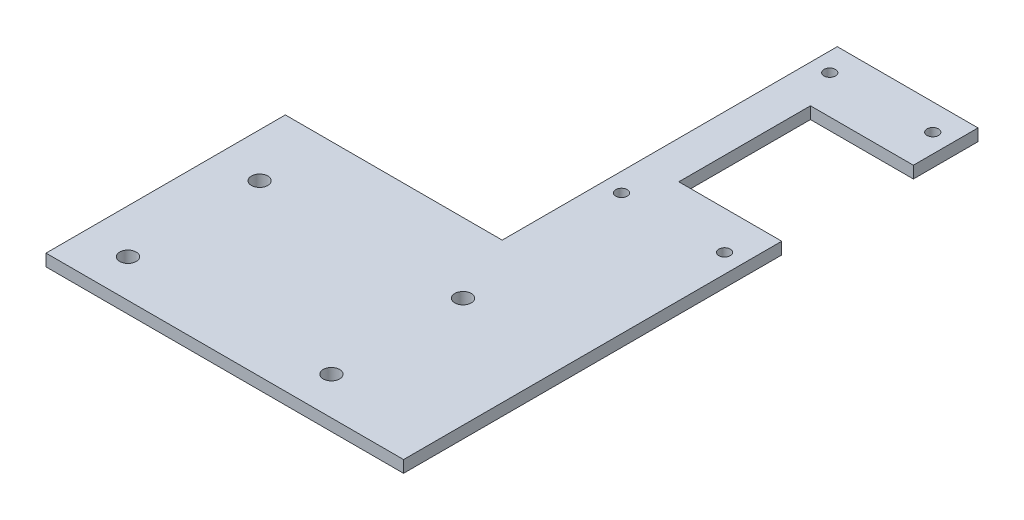
ISO-10303-21;
HEADER;
FILE_DESCRIPTION(('STEP AP214'),'2;1');
FILE_NAME('part.step','',(''),(''),'','','');
FILE_SCHEMA(('AUTOMOTIVE_DESIGN { 1 0 10303 214 1 1 1 1 }'));
ENDSEC;
DATA;
#1=APPLICATION_CONTEXT('core data for automotive mechanical design processes');
#2=APPLICATION_PROTOCOL_DEFINITION('international standard','automotive_design',2000,#1);
#3=PRODUCT_CONTEXT('',#1,'mechanical');
#4=PRODUCT('Part','Part','',(#3));
#5=PRODUCT_RELATED_PRODUCT_CATEGORY('part','',(#4));
#6=PRODUCT_DEFINITION_FORMATION('','',#4);
#7=PRODUCT_DEFINITION_CONTEXT('part definition',#1,'design');
#8=PRODUCT_DEFINITION('design','',#6,#7);
#9=PRODUCT_DEFINITION_SHAPE('','',#8);
#10=(LENGTH_UNIT() NAMED_UNIT(*) SI_UNIT(.MILLI.,.METRE.));
#11=(NAMED_UNIT(*) PLANE_ANGLE_UNIT() SI_UNIT($,.RADIAN.));
#12=(NAMED_UNIT(*) SI_UNIT($,.STERADIAN.) SOLID_ANGLE_UNIT());
#13=UNCERTAINTY_MEASURE_WITH_UNIT(LENGTH_MEASURE(1.E-05),#10,'distance_accuracy_value','');
#14=(GEOMETRIC_REPRESENTATION_CONTEXT(3) GLOBAL_UNCERTAINTY_ASSIGNED_CONTEXT((#13)) GLOBAL_UNIT_ASSIGNED_CONTEXT((#10,
#11,#12)) REPRESENTATION_CONTEXT('',''));
#15=CARTESIAN_POINT('',(0.,0.,0.));
#16=DIRECTION('',(0.,0.,1.));
#17=DIRECTION('',(1.,0.,0.));
#18=AXIS2_PLACEMENT_3D('',#15,#16,#17);
#19=CARTESIAN_POINT('',(0.,6.35,25.4));
#20=DIRECTION('',(0.,0.,1.));
#21=DIRECTION('',(1.,0.,0.));
#22=AXIS2_PLACEMENT_3D('',#19,#20,#21);
#23=PLANE('',#22);
#24=DIRECTION('',(-1.,0.,0.));
#25=VECTOR('',#24,1.);
#26=CARTESIAN_POINT('',(0.,0.,25.4));
#27=LINE('',#26,#25);
#28=CARTESIAN_POINT('',(77.73162,0.,25.4));
#29=VERTEX_POINT('',#28);
#30=CARTESIAN_POINT('',(-37.33419,0.,25.4));
#31=VERTEX_POINT('',#30);
#32=EDGE_CURVE('E192',#29,#31,#27,.T.);
#33=ORIENTED_EDGE('',*,*,#32,.T.);
#34=DIRECTION('',(0.,-1.,0.));
#35=VECTOR('',#34,1.);
#36=CARTESIAN_POINT('',(-37.33419,6.35,25.4));
#37=LINE('',#36,#35);
#38=CARTESIAN_POINT('',(-37.33419,6.35,25.4));
#39=VERTEX_POINT('',#38);
#40=EDGE_CURVE('E11',#39,#31,#37,.T.);
#41=ORIENTED_EDGE('',*,*,#40,.F.);
#42=DIRECTION('',(-1.,0.,0.));
#43=VECTOR('',#42,1.);
#44=CARTESIAN_POINT('',(0.,6.35,25.4));
#45=LINE('',#44,#43);
#46=CARTESIAN_POINT('',(77.73162,6.35,25.4));
#47=VERTEX_POINT('',#46);
#48=EDGE_CURVE('E309',#47,#39,#45,.T.);
#49=ORIENTED_EDGE('',*,*,#48,.F.);
#50=DIRECTION('',(0.,-1.,0.));
#51=VECTOR('',#50,1.);
#52=CARTESIAN_POINT('',(77.73162,6.35,25.4));
#53=LINE('',#52,#51);
#54=EDGE_CURVE('E155',#47,#29,#53,.T.);
#55=ORIENTED_EDGE('',*,*,#54,.T.);
#56=EDGE_LOOP('',(#33,#41,#49,#55));
#57=FACE_BOUND('',#56,.T.);
#58=ADVANCED_FACE('F45',(#57),#23,.F.);
#59=CARTESIAN_POINT('',(-37.33419,6.35,0.));
#60=DIRECTION('',(1.,0.,0.));
#61=DIRECTION('',(0.,0.,-1.));
#62=AXIS2_PLACEMENT_3D('',#59,#60,#61);
#63=PLANE('',#62);
#64=DIRECTION('',(0.,0.,1.));
#65=VECTOR('',#64,1.);
#66=CARTESIAN_POINT('',(-37.33419,0.,0.));
#67=LINE('',#66,#65);
#68=CARTESIAN_POINT('',(-37.33419,0.,152.4));
#69=VERTEX_POINT('',#68);
#70=EDGE_CURVE('E196',#31,#69,#67,.T.);
#71=ORIENTED_EDGE('',*,*,#70,.T.);
#72=DIRECTION('',(0.,-1.,0.));
#73=VECTOR('',#72,1.);
#74=CARTESIAN_POINT('',(-37.33419,6.35,152.4));
#75=LINE('',#74,#73);
#76=CARTESIAN_POINT('',(-37.33419,6.35,152.4));
#77=VERTEX_POINT('',#76);
#78=EDGE_CURVE('E55',#77,#69,#75,.T.);
#79=ORIENTED_EDGE('',*,*,#78,.F.);
#80=DIRECTION('',(0.,0.,1.));
#81=VECTOR('',#80,1.);
#82=CARTESIAN_POINT('',(-37.33419,6.35,0.));
#83=LINE('',#82,#81);
#84=EDGE_CURVE('E108',#39,#77,#83,.T.);
#85=ORIENTED_EDGE('',*,*,#84,.F.);
#86=ORIENTED_EDGE('',*,*,#40,.T.);
#87=EDGE_LOOP('',(#71,#79,#85,#86));
#88=FACE_BOUND('',#87,.T.);
#89=ADVANCED_FACE('F316',(#88),#63,.F.);
#90=CARTESIAN_POINT('',(0.,6.35,152.4));
#91=DIRECTION('',(0.,0.,-1.));
#92=DIRECTION('',(-1.,0.,0.));
#93=AXIS2_PLACEMENT_3D('',#90,#91,#92);
#94=PLANE('',#93);
#95=DIRECTION('',(1.,0.,0.));
#96=VECTOR('',#95,1.);
#97=CARTESIAN_POINT('',(0.,0.,152.4));
#98=LINE('',#97,#96);
#99=CARTESIAN_POINT('',(152.4,0.,152.4));
#100=VERTEX_POINT('',#99);
#101=EDGE_CURVE('E199',#69,#100,#98,.T.);
#102=ORIENTED_EDGE('',*,*,#101,.T.);
#103=DIRECTION('',(0.,-1.,0.));
#104=VECTOR('',#103,1.);
#105=CARTESIAN_POINT('',(152.4,6.35,152.4));
#106=LINE('',#105,#104);
#107=CARTESIAN_POINT('',(152.4,6.35,152.4));
#108=VERTEX_POINT('',#107);
#109=EDGE_CURVE('E239',#108,#100,#106,.T.);
#110=ORIENTED_EDGE('',*,*,#109,.F.);
#111=DIRECTION('',(1.,0.,0.));
#112=VECTOR('',#111,1.);
#113=CARTESIAN_POINT('',(0.,6.35,152.4));
#114=LINE('',#113,#112);
#115=EDGE_CURVE('E249',#77,#108,#114,.T.);
#116=ORIENTED_EDGE('',*,*,#115,.F.);
#117=ORIENTED_EDGE('',*,*,#78,.T.);
#118=EDGE_LOOP('',(#102,#110,#116,#117));
#119=FACE_BOUND('',#118,.T.);
#120=ADVANCED_FACE('F247',(#119),#94,.F.);
#121=CARTESIAN_POINT('',(152.4,6.35,0.));
#122=DIRECTION('',(-1.,0.,0.));
#123=DIRECTION('',(0.,0.,1.));
#124=AXIS2_PLACEMENT_3D('',#121,#122,#123);
#125=PLANE('',#124);
#126=DIRECTION('',(0.,0.,-1.));
#127=VECTOR('',#126,1.);
#128=CARTESIAN_POINT('',(152.4,0.,0.));
#129=LINE('',#128,#127);
#130=CARTESIAN_POINT('',(152.4,0.,-48.26));
#131=VERTEX_POINT('',#130);
#132=EDGE_CURVE('E202',#100,#131,#129,.T.);
#133=ORIENTED_EDGE('',*,*,#132,.T.);
#134=DIRECTION('',(0.,-1.,0.));
#135=VECTOR('',#134,1.);
#136=CARTESIAN_POINT('',(152.4,6.35,-48.26));
#137=LINE('',#136,#135);
#138=CARTESIAN_POINT('',(152.4,6.35,-48.26));
#139=VERTEX_POINT('',#138);
#140=EDGE_CURVE('E236',#139,#131,#137,.T.);
#141=ORIENTED_EDGE('',*,*,#140,.F.);
#142=DIRECTION('',(0.,0.,-1.));
#143=VECTOR('',#142,1.);
#144=CARTESIAN_POINT('',(152.4,6.35,0.));
#145=LINE('',#144,#143);
#146=EDGE_CURVE('E139',#108,#139,#145,.T.);
#147=ORIENTED_EDGE('',*,*,#146,.F.);
#148=ORIENTED_EDGE('',*,*,#109,.T.);
#149=EDGE_LOOP('',(#133,#141,#147,#148));
#150=FACE_BOUND('',#149,.T.);
#151=ADVANCED_FACE('F257',(#150),#125,.F.);
#152=CARTESIAN_POINT('',(0.,6.35,-48.26));
#153=DIRECTION('',(0.,0.,-1.));
#154=DIRECTION('',(-1.,0.,0.));
#155=AXIS2_PLACEMENT_3D('',#152,#153,#154);
#156=PLANE('',#155);
#157=DIRECTION('',(1.,0.,0.));
#158=VECTOR('',#157,1.);
#159=CARTESIAN_POINT('',(0.,0.,-48.26));
#160=LINE('',#159,#158);
#161=CARTESIAN_POINT('',(97.79,0.,-48.26));
#162=VERTEX_POINT('',#161);
#163=EDGE_CURVE('E206',#162,#131,#160,.T.);
#164=ORIENTED_EDGE('',*,*,#163,.F.);
#165=DIRECTION('',(0.,-1.,0.));
#166=VECTOR('',#165,1.);
#167=CARTESIAN_POINT('',(97.79,6.35,-48.26));
#168=LINE('',#167,#166);
#169=CARTESIAN_POINT('',(97.79,6.35,-48.26));
#170=VERTEX_POINT('',#169);
#171=EDGE_CURVE('E233',#170,#162,#168,.T.);
#172=ORIENTED_EDGE('',*,*,#171,.F.);
#173=DIRECTION('',(1.,0.,0.));
#174=VECTOR('',#173,1.);
#175=CARTESIAN_POINT('',(0.,6.35,-48.26));
#176=LINE('',#175,#174);
#177=EDGE_CURVE('E262',#170,#139,#176,.T.);
#178=ORIENTED_EDGE('',*,*,#177,.T.);
#179=ORIENTED_EDGE('',*,*,#140,.T.);
#180=EDGE_LOOP('',(#164,#172,#178,#179));
#181=FACE_BOUND('',#180,.T.);
#182=ADVANCED_FACE('F399',(#181),#156,.T.);
#183=CARTESIAN_POINT('',(97.79,6.35,0.));
#184=DIRECTION('',(1.,0.,0.));
#185=DIRECTION('',(0.,0.,-1.));
#186=AXIS2_PLACEMENT_3D('',#183,#184,#185);
#187=PLANE('',#186);
#188=DIRECTION('',(0.,0.,1.));
#189=VECTOR('',#188,1.);
#190=CARTESIAN_POINT('',(97.79,0.,0.));
#191=LINE('',#190,#189);
#192=CARTESIAN_POINT('',(97.79,0.,-118.11));
#193=VERTEX_POINT('',#192);
#194=EDGE_CURVE('E210',#193,#162,#191,.T.);
#195=ORIENTED_EDGE('',*,*,#194,.F.);
#196=DIRECTION('',(0.,-1.,0.));
#197=VECTOR('',#196,1.);
#198=CARTESIAN_POINT('',(97.79,6.35,-118.11));
#199=LINE('',#198,#197);
#200=CARTESIAN_POINT('',(97.79,6.35,-118.11));
#201=VERTEX_POINT('',#200);
#202=EDGE_CURVE('E230',#201,#193,#199,.T.);
#203=ORIENTED_EDGE('',*,*,#202,.F.);
#204=DIRECTION('',(0.,0.,1.));
#205=VECTOR('',#204,1.);
#206=CARTESIAN_POINT('',(97.79,6.35,0.));
#207=LINE('',#206,#205);
#208=EDGE_CURVE('E265',#201,#170,#207,.T.);
#209=ORIENTED_EDGE('',*,*,#208,.T.);
#210=ORIENTED_EDGE('',*,*,#171,.T.);
#211=EDGE_LOOP('',(#195,#203,#209,#210));
#212=FACE_BOUND('',#211,.T.);
#213=ADVANCED_FACE('F397',(#212),#187,.T.);
#214=CARTESIAN_POINT('',(0.,6.35,-118.11));
#215=DIRECTION('',(0.,0.,1.));
#216=DIRECTION('',(1.,0.,0.));
#217=AXIS2_PLACEMENT_3D('',#214,#215,#216);
#218=PLANE('',#217);
#219=DIRECTION('',(-1.,0.,0.));
#220=VECTOR('',#219,1.);
#221=CARTESIAN_POINT('',(0.,0.,-118.11));
#222=LINE('',#221,#220);
#223=CARTESIAN_POINT('',(152.4,0.,-118.11));
#224=VERTEX_POINT('',#223);
#225=EDGE_CURVE('E214',#224,#193,#222,.T.);
#226=ORIENTED_EDGE('',*,*,#225,.F.);
#227=DIRECTION('',(0.,-1.,0.));
#228=VECTOR('',#227,1.);
#229=CARTESIAN_POINT('',(152.4,6.35,-118.11));
#230=LINE('',#229,#228);
#231=CARTESIAN_POINT('',(152.4,6.35,-118.11));
#232=VERTEX_POINT('',#231);
#233=EDGE_CURVE('E149',#232,#224,#230,.T.);
#234=ORIENTED_EDGE('',*,*,#233,.F.);
#235=DIRECTION('',(-1.,0.,0.));
#236=VECTOR('',#235,1.);
#237=CARTESIAN_POINT('',(0.,6.35,-118.11));
#238=LINE('',#237,#236);
#239=EDGE_CURVE('E135',#232,#201,#238,.T.);
#240=ORIENTED_EDGE('',*,*,#239,.T.);
#241=ORIENTED_EDGE('',*,*,#202,.T.);
#242=EDGE_LOOP('',(#226,#234,#240,#241));
#243=FACE_BOUND('',#242,.T.);
#244=ADVANCED_FACE('F275',(#243),#218,.T.);
#245=CARTESIAN_POINT('',(152.4,0.,-152.4));
#246=VERTEX_POINT('',#245);
#247=EDGE_CURVE('E144',#224,#246,#129,.T.);
#248=ORIENTED_EDGE('',*,*,#247,.T.);
#249=DIRECTION('',(0.,-1.,0.));
#250=VECTOR('',#249,1.);
#251=CARTESIAN_POINT('',(152.4,6.35,-152.4));
#252=LINE('',#251,#250);
#253=CARTESIAN_POINT('',(152.4,6.35,-152.4));
#254=VERTEX_POINT('',#253);
#255=EDGE_CURVE('E141',#254,#246,#252,.T.);
#256=ORIENTED_EDGE('',*,*,#255,.F.);
#257=EDGE_CURVE('E128',#232,#254,#145,.T.);
#258=ORIENTED_EDGE('',*,*,#257,.F.);
#259=ORIENTED_EDGE('',*,*,#233,.T.);
#260=EDGE_LOOP('',(#248,#256,#258,#259));
#261=FACE_BOUND('',#260,.T.);
#262=ADVANCED_FACE('F142',(#261),#125,.F.);
#263=CARTESIAN_POINT('',(0.,6.35,-152.4));
#264=DIRECTION('',(0.,0.,-1.));
#265=DIRECTION('',(-1.,0.,0.));
#266=AXIS2_PLACEMENT_3D('',#263,#264,#265);
#267=PLANE('',#266);
#268=DIRECTION('',(1.,0.,0.));
#269=VECTOR('',#268,1.);
#270=CARTESIAN_POINT('',(0.,0.,-152.4));
#271=LINE('',#270,#269);
#272=CARTESIAN_POINT('',(77.73162,0.,-152.4));
#273=VERTEX_POINT('',#272);
#274=EDGE_CURVE('E218',#273,#246,#271,.T.);
#275=ORIENTED_EDGE('',*,*,#274,.F.);
#276=DIRECTION('',(0.,-1.,0.));
#277=VECTOR('',#276,1.);
#278=CARTESIAN_POINT('',(77.73162,6.35,-152.4));
#279=LINE('',#278,#277);
#280=CARTESIAN_POINT('',(77.73162,6.35,-152.4));
#281=VERTEX_POINT('',#280);
#282=EDGE_CURVE('E97',#281,#273,#279,.T.);
#283=ORIENTED_EDGE('',*,*,#282,.F.);
#284=DIRECTION('',(1.,0.,0.));
#285=VECTOR('',#284,1.);
#286=CARTESIAN_POINT('',(0.,6.35,-152.4));
#287=LINE('',#286,#285);
#288=EDGE_CURVE('E132',#281,#254,#287,.T.);
#289=ORIENTED_EDGE('',*,*,#288,.T.);
#290=ORIENTED_EDGE('',*,*,#255,.T.);
#291=EDGE_LOOP('',(#275,#283,#289,#290));
#292=FACE_BOUND('',#291,.T.);
#293=ADVANCED_FACE('F151',(#292),#267,.T.);
#294=CARTESIAN_POINT('',(142.367,6.35,-138.43));
#295=DIRECTION('',(0.,-1.,0.));
#296=DIRECTION('',(0.,0.,-1.));
#297=AXIS2_PLACEMENT_3D('',#294,#295,#296);
#298=CYLINDRICAL_SURFACE('',#297,3.04799999999998);
#299=CARTESIAN_POINT('',(142.367,6.35,-138.43));
#300=DIRECTION('',(0.,1.,0.));
#301=DIRECTION('',(0.,0.,1.));
#302=AXIS2_PLACEMENT_3D('',#299,#300,#301);
#303=CIRCLE('',#302,3.04799999999998);
#304=CARTESIAN_POINT('',(142.367,6.35,-135.382));
#305=VERTEX_POINT('',#304);
#306=EDGE_CURVE('E305',#305,#305,#303,.T.);
#307=ORIENTED_EDGE('',*,*,#306,.T.);
#308=EDGE_LOOP('',(#307));
#309=FACE_BOUND('',#308,.T.);
#310=CARTESIAN_POINT('',(142.367,0.,-138.43));
#311=DIRECTION('',(0.,1.,0.));
#312=DIRECTION('',(0.,0.,1.));
#313=AXIS2_PLACEMENT_3D('',#310,#311,#312);
#314=CIRCLE('',#313,3.04799999999998);
#315=CARTESIAN_POINT('',(142.367,0.,-135.382));
#316=VERTEX_POINT('',#315);
#317=EDGE_CURVE('E188',#316,#316,#314,.T.);
#318=ORIENTED_EDGE('',*,*,#317,.F.);
#319=EDGE_LOOP('',(#318));
#320=FACE_BOUND('',#319,.T.);
#321=ADVANCED_FACE('F327',(#309,#320),#298,.F.);
#322=CARTESIAN_POINT('',(87.68842,6.35,-138.43));
#323=DIRECTION('',(0.,-1.,0.));
#324=DIRECTION('',(0.,0.,-1.));
#325=AXIS2_PLACEMENT_3D('',#322,#323,#324);
#326=CYLINDRICAL_SURFACE('',#325,3.048);
#327=CARTESIAN_POINT('',(87.68842,6.35,-138.43));
#328=DIRECTION('',(0.,1.,0.));
#329=DIRECTION('',(0.,0.,1.));
#330=AXIS2_PLACEMENT_3D('',#327,#328,#329);
#331=CIRCLE('',#330,3.048);
#332=CARTESIAN_POINT('',(87.68842,6.35,-135.382));
#333=VERTEX_POINT('',#332);
#334=EDGE_CURVE('E301',#333,#333,#331,.T.);
#335=ORIENTED_EDGE('',*,*,#334,.T.);
#336=EDGE_LOOP('',(#335));
#337=FACE_BOUND('',#336,.T.);
#338=CARTESIAN_POINT('',(87.68842,0.,-138.43));
#339=DIRECTION('',(0.,1.,0.));
#340=DIRECTION('',(0.,0.,1.));
#341=AXIS2_PLACEMENT_3D('',#338,#339,#340);
#342=CIRCLE('',#341,3.048);
#343=CARTESIAN_POINT('',(87.68842,0.,-135.382));
#344=VERTEX_POINT('',#343);
#345=EDGE_CURVE('E184',#344,#344,#342,.T.);
#346=ORIENTED_EDGE('',*,*,#345,.F.);
#347=EDGE_LOOP('',(#346));
#348=FACE_BOUND('',#347,.T.);
#349=ADVANCED_FACE('F330',(#337,#348),#326,.F.);
#350=CARTESIAN_POINT('',(142.367,6.35,-27.94));
#351=DIRECTION('',(0.,-1.,0.));
#352=DIRECTION('',(0.,0.,-1.));
#353=AXIS2_PLACEMENT_3D('',#350,#351,#352);
#354=CYLINDRICAL_SURFACE('',#353,3.04799999999998);
#355=CARTESIAN_POINT('',(142.367,6.35,-27.94));
#356=DIRECTION('',(0.,1.,0.));
#357=DIRECTION('',(0.,0.,1.));
#358=AXIS2_PLACEMENT_3D('',#355,#356,#357);
#359=CIRCLE('',#358,3.04799999999998);
#360=CARTESIAN_POINT('',(142.367,6.35,-24.892));
#361=VERTEX_POINT('',#360);
#362=EDGE_CURVE('E297',#361,#361,#359,.T.);
#363=ORIENTED_EDGE('',*,*,#362,.T.);
#364=EDGE_LOOP('',(#363));
#365=FACE_BOUND('',#364,.T.);
#366=CARTESIAN_POINT('',(142.367,0.,-27.94));
#367=DIRECTION('',(0.,1.,0.));
#368=DIRECTION('',(0.,0.,1.));
#369=AXIS2_PLACEMENT_3D('',#366,#367,#368);
#370=CIRCLE('',#369,3.04799999999998);
#371=CARTESIAN_POINT('',(142.367,0.,-24.892));
#372=VERTEX_POINT('',#371);
#373=EDGE_CURVE('E180',#372,#372,#370,.T.);
#374=ORIENTED_EDGE('',*,*,#373,.F.);
#375=EDGE_LOOP('',(#374));
#376=FACE_BOUND('',#375,.T.);
#377=ADVANCED_FACE('F334',(#365,#376),#354,.F.);
#378=CARTESIAN_POINT('',(87.68842,6.35,-27.94));
#379=DIRECTION('',(0.,-1.,0.));
#380=DIRECTION('',(0.,0.,-1.));
#381=AXIS2_PLACEMENT_3D('',#378,#379,#380);
#382=CYLINDRICAL_SURFACE('',#381,3.048);
#383=CARTESIAN_POINT('',(87.68842,6.35,-27.94));
#384=DIRECTION('',(0.,1.,0.));
#385=DIRECTION('',(0.,0.,1.));
#386=AXIS2_PLACEMENT_3D('',#383,#384,#385);
#387=CIRCLE('',#386,3.048);
#388=CARTESIAN_POINT('',(87.68842,6.35,-24.892));
#389=VERTEX_POINT('',#388);
#390=EDGE_CURVE('E293',#389,#389,#387,.T.);
#391=ORIENTED_EDGE('',*,*,#390,.T.);
#392=EDGE_LOOP('',(#391));
#393=FACE_BOUND('',#392,.T.);
#394=CARTESIAN_POINT('',(87.68842,0.,-27.94));
#395=DIRECTION('',(0.,1.,0.));
#396=DIRECTION('',(0.,0.,1.));
#397=AXIS2_PLACEMENT_3D('',#394,#395,#396);
#398=CIRCLE('',#397,3.048);
#399=CARTESIAN_POINT('',(87.68842,0.,-24.892));
#400=VERTEX_POINT('',#399);
#401=EDGE_CURVE('E176',#400,#400,#398,.T.);
#402=ORIENTED_EDGE('',*,*,#401,.F.);
#403=EDGE_LOOP('',(#402));
#404=FACE_BOUND('',#403,.T.);
#405=ADVANCED_FACE('F338',(#393,#404),#382,.F.);
#406=CARTESIAN_POINT('',(-13.91158,6.35,62.484));
#407=DIRECTION('',(0.,-1.,0.));
#408=DIRECTION('',(0.,0.,-1.));
#409=AXIS2_PLACEMENT_3D('',#406,#407,#408);
#410=CYLINDRICAL_SURFACE('',#409,4.3688);
#411=CARTESIAN_POINT('',(-13.91158,6.35,62.484));
#412=DIRECTION('',(0.,1.,0.));
#413=DIRECTION('',(0.,0.,1.));
#414=AXIS2_PLACEMENT_3D('',#411,#412,#413);
#415=CIRCLE('',#414,4.3688);
#416=CARTESIAN_POINT('',(-13.91158,6.35,66.8528));
#417=VERTEX_POINT('',#416);
#418=EDGE_CURVE('E289',#417,#417,#415,.T.);
#419=ORIENTED_EDGE('',*,*,#418,.T.);
#420=EDGE_LOOP('',(#419));
#421=FACE_BOUND('',#420,.T.);
#422=CARTESIAN_POINT('',(-13.91158,0.,62.484));
#423=DIRECTION('',(0.,1.,0.));
#424=DIRECTION('',(0.,0.,1.));
#425=AXIS2_PLACEMENT_3D('',#422,#423,#424);
#426=CIRCLE('',#425,4.3688);
#427=CARTESIAN_POINT('',(-13.91158,0.,66.8528));
#428=VERTEX_POINT('',#427);
#429=EDGE_CURVE('E172',#428,#428,#426,.T.);
#430=ORIENTED_EDGE('',*,*,#429,.F.);
#431=EDGE_LOOP('',(#430));
#432=FACE_BOUND('',#431,.T.);
#433=ADVANCED_FACE('F342',(#421,#432),#410,.F.);
#434=CARTESIAN_POINT('',(94.03842,6.35,62.484));
#435=DIRECTION('',(0.,-1.,0.));
#436=DIRECTION('',(0.,0.,-1.));
#437=AXIS2_PLACEMENT_3D('',#434,#435,#436);
#438=CYLINDRICAL_SURFACE('',#437,4.36879999999999);
#439=CARTESIAN_POINT('',(94.03842,6.35,62.484));
#440=DIRECTION('',(0.,1.,0.));
#441=DIRECTION('',(0.,0.,1.));
#442=AXIS2_PLACEMENT_3D('',#439,#440,#441);
#443=CIRCLE('',#442,4.36879999999999);
#444=CARTESIAN_POINT('',(94.03842,6.35,66.8528));
#445=VERTEX_POINT('',#444);
#446=EDGE_CURVE('E285',#445,#445,#443,.T.);
#447=ORIENTED_EDGE('',*,*,#446,.T.);
#448=EDGE_LOOP('',(#447));
#449=FACE_BOUND('',#448,.T.);
#450=CARTESIAN_POINT('',(94.03842,0.,62.484));
#451=DIRECTION('',(0.,1.,0.));
#452=DIRECTION('',(0.,0.,1.));
#453=AXIS2_PLACEMENT_3D('',#450,#451,#452);
#454=CIRCLE('',#453,4.36879999999999);
#455=CARTESIAN_POINT('',(94.03842,0.,66.8528));
#456=VERTEX_POINT('',#455);
#457=EDGE_CURVE('E168',#456,#456,#454,.T.);
#458=ORIENTED_EDGE('',*,*,#457,.F.);
#459=EDGE_LOOP('',(#458));
#460=FACE_BOUND('',#459,.T.);
#461=ADVANCED_FACE('F346',(#449,#460),#438,.F.);
#462=CARTESIAN_POINT('',(-13.91158,6.35,132.334));
#463=DIRECTION('',(0.,-1.,0.));
#464=DIRECTION('',(0.,0.,-1.));
#465=AXIS2_PLACEMENT_3D('',#462,#463,#464);
#466=CYLINDRICAL_SURFACE('',#465,4.3688);
#467=CARTESIAN_POINT('',(-13.91158,6.35,132.334));
#468=DIRECTION('',(0.,1.,0.));
#469=DIRECTION('',(0.,0.,1.));
#470=AXIS2_PLACEMENT_3D('',#467,#468,#469);
#471=CIRCLE('',#470,4.3688);
#472=CARTESIAN_POINT('',(-13.91158,6.35,136.7028));
#473=VERTEX_POINT('',#472);
#474=EDGE_CURVE('E281',#473,#473,#471,.T.);
#475=ORIENTED_EDGE('',*,*,#474,.T.);
#476=EDGE_LOOP('',(#475));
#477=FACE_BOUND('',#476,.T.);
#478=CARTESIAN_POINT('',(-13.91158,0.,132.334));
#479=DIRECTION('',(0.,1.,0.));
#480=DIRECTION('',(0.,0.,1.));
#481=AXIS2_PLACEMENT_3D('',#478,#479,#480);
#482=CIRCLE('',#481,4.3688);
#483=CARTESIAN_POINT('',(-13.91158,0.,136.7028));
#484=VERTEX_POINT('',#483);
#485=EDGE_CURVE('E164',#484,#484,#482,.T.);
#486=ORIENTED_EDGE('',*,*,#485,.F.);
#487=EDGE_LOOP('',(#486));
#488=FACE_BOUND('',#487,.T.);
#489=ADVANCED_FACE('F349',(#477,#488),#466,.F.);
#490=CARTESIAN_POINT('',(94.03842,6.35,132.334));
#491=DIRECTION('',(0.,-1.,0.));
#492=DIRECTION('',(0.,0.,-1.));
#493=AXIS2_PLACEMENT_3D('',#490,#491,#492);
#494=CYLINDRICAL_SURFACE('',#493,4.36879999999999);
#495=CARTESIAN_POINT('',(94.03842,6.35,132.334));
#496=DIRECTION('',(0.,1.,0.));
#497=DIRECTION('',(0.,0.,1.));
#498=AXIS2_PLACEMENT_3D('',#495,#496,#497);
#499=CIRCLE('',#498,4.36879999999999);
#500=CARTESIAN_POINT('',(94.03842,6.35,136.7028));
#501=VERTEX_POINT('',#500);
#502=EDGE_CURVE('E223',#501,#501,#499,.T.);
#503=ORIENTED_EDGE('',*,*,#502,.T.);
#504=EDGE_LOOP('',(#503));
#505=FACE_BOUND('',#504,.T.);
#506=CARTESIAN_POINT('',(94.03842,0.,132.334));
#507=DIRECTION('',(0.,1.,0.));
#508=DIRECTION('',(0.,0.,1.));
#509=AXIS2_PLACEMENT_3D('',#506,#507,#508);
#510=CIRCLE('',#509,4.36879999999999);
#511=CARTESIAN_POINT('',(94.03842,0.,136.7028));
#512=VERTEX_POINT('',#511);
#513=EDGE_CURVE('E160',#512,#512,#510,.T.);
#514=ORIENTED_EDGE('',*,*,#513,.F.);
#515=EDGE_LOOP('',(#514));
#516=FACE_BOUND('',#515,.T.);
#517=ADVANCED_FACE('F47',(#505,#516),#494,.F.);
#518=CARTESIAN_POINT('',(77.73162,6.35,0.));
#519=DIRECTION('',(1.,0.,0.));
#520=DIRECTION('',(0.,0.,-1.));
#521=AXIS2_PLACEMENT_3D('',#518,#519,#520);
#522=PLANE('',#521);
#523=DIRECTION('',(0.,0.,1.));
#524=VECTOR('',#523,1.);
#525=CARTESIAN_POINT('',(77.73162,0.,0.));
#526=LINE('',#525,#524);
#527=EDGE_CURVE('E100',#273,#29,#526,.T.);
#528=ORIENTED_EDGE('',*,*,#527,.T.);
#529=ORIENTED_EDGE('',*,*,#54,.F.);
#530=DIRECTION('',(0.,0.,1.));
#531=VECTOR('',#530,1.);
#532=CARTESIAN_POINT('',(77.73162,6.35,0.));
#533=LINE('',#532,#531);
#534=EDGE_CURVE('E63',#281,#47,#533,.T.);
#535=ORIENTED_EDGE('',*,*,#534,.F.);
#536=ORIENTED_EDGE('',*,*,#282,.T.);
#537=EDGE_LOOP('',(#528,#529,#535,#536));
#538=FACE_BOUND('',#537,.T.);
#539=ADVANCED_FACE('F356',(#538),#522,.F.);
#540=CARTESIAN_POINT('',(0.,6.35,0.));
#541=DIRECTION('',(0.,1.,0.));
#542=DIRECTION('',(0.,0.,1.));
#543=AXIS2_PLACEMENT_3D('',#540,#541,#542);
#544=PLANE('',#543);
#545=ORIENTED_EDGE('',*,*,#502,.F.);
#546=EDGE_LOOP('',(#545));
#547=FACE_BOUND('',#546,.T.);
#548=ORIENTED_EDGE('',*,*,#474,.F.);
#549=EDGE_LOOP('',(#548));
#550=FACE_BOUND('',#549,.T.);
#551=ORIENTED_EDGE('',*,*,#446,.F.);
#552=EDGE_LOOP('',(#551));
#553=FACE_BOUND('',#552,.T.);
#554=ORIENTED_EDGE('',*,*,#418,.F.);
#555=EDGE_LOOP('',(#554));
#556=FACE_BOUND('',#555,.T.);
#557=ORIENTED_EDGE('',*,*,#390,.F.);
#558=EDGE_LOOP('',(#557));
#559=FACE_BOUND('',#558,.T.);
#560=ORIENTED_EDGE('',*,*,#362,.F.);
#561=EDGE_LOOP('',(#560));
#562=FACE_BOUND('',#561,.T.);
#563=ORIENTED_EDGE('',*,*,#334,.F.);
#564=EDGE_LOOP('',(#563));
#565=FACE_BOUND('',#564,.T.);
#566=ORIENTED_EDGE('',*,*,#306,.F.);
#567=EDGE_LOOP('',(#566));
#568=FACE_BOUND('',#567,.T.);
#569=ORIENTED_EDGE('',*,*,#48,.T.);
#570=ORIENTED_EDGE('',*,*,#84,.T.);
#571=ORIENTED_EDGE('',*,*,#115,.T.);
#572=ORIENTED_EDGE('',*,*,#146,.T.);
#573=ORIENTED_EDGE('',*,*,#177,.F.);
#574=ORIENTED_EDGE('',*,*,#208,.F.);
#575=ORIENTED_EDGE('',*,*,#239,.F.);
#576=ORIENTED_EDGE('',*,*,#257,.T.);
#577=ORIENTED_EDGE('',*,*,#288,.F.);
#578=ORIENTED_EDGE('',*,*,#534,.T.);
#579=EDGE_LOOP('',(#569,#570,#571,#572,#573,#574,#575,#576,#577,#578));
#580=FACE_BOUND('',#579,.T.);
#581=ADVANCED_FACE('F130',(#547,#550,#553,#556,#559,#562,#565,#568,#580),#544,.T.);
#582=CARTESIAN_POINT('',(0.,0.,0.));
#583=DIRECTION('',(0.,1.,0.));
#584=DIRECTION('',(0.,0.,1.));
#585=AXIS2_PLACEMENT_3D('',#582,#583,#584);
#586=PLANE('',#585);
#587=ORIENTED_EDGE('',*,*,#513,.T.);
#588=EDGE_LOOP('',(#587));
#589=FACE_BOUND('',#588,.T.);
#590=ORIENTED_EDGE('',*,*,#485,.T.);
#591=EDGE_LOOP('',(#590));
#592=FACE_BOUND('',#591,.T.);
#593=ORIENTED_EDGE('',*,*,#457,.T.);
#594=EDGE_LOOP('',(#593));
#595=FACE_BOUND('',#594,.T.);
#596=ORIENTED_EDGE('',*,*,#429,.T.);
#597=EDGE_LOOP('',(#596));
#598=FACE_BOUND('',#597,.T.);
#599=ORIENTED_EDGE('',*,*,#401,.T.);
#600=EDGE_LOOP('',(#599));
#601=FACE_BOUND('',#600,.T.);
#602=ORIENTED_EDGE('',*,*,#373,.T.);
#603=EDGE_LOOP('',(#602));
#604=FACE_BOUND('',#603,.T.);
#605=ORIENTED_EDGE('',*,*,#345,.T.);
#606=EDGE_LOOP('',(#605));
#607=FACE_BOUND('',#606,.T.);
#608=ORIENTED_EDGE('',*,*,#317,.T.);
#609=EDGE_LOOP('',(#608));
#610=FACE_BOUND('',#609,.T.);
#611=ORIENTED_EDGE('',*,*,#32,.F.);
#612=ORIENTED_EDGE('',*,*,#527,.F.);
#613=ORIENTED_EDGE('',*,*,#274,.T.);
#614=ORIENTED_EDGE('',*,*,#247,.F.);
#615=ORIENTED_EDGE('',*,*,#225,.T.);
#616=ORIENTED_EDGE('',*,*,#194,.T.);
#617=ORIENTED_EDGE('',*,*,#163,.T.);
#618=ORIENTED_EDGE('',*,*,#132,.F.);
#619=ORIENTED_EDGE('',*,*,#101,.F.);
#620=ORIENTED_EDGE('',*,*,#70,.F.);
#621=EDGE_LOOP('',(#611,#612,#613,#614,#615,#616,#617,#618,#619,#620));
#622=FACE_BOUND('',#621,.T.);
#623=ADVANCED_FACE('F253',(#589,#592,#595,#598,#601,#604,#607,#610,#622),#586,.F.);
#624=CLOSED_SHELL('',(#58,#89,#120,#151,#182,#213,#244,#262,#293,#321,#349,#377,#405,#433,#461,
#489,#517,#539,#581,#623));
#625=MANIFOLD_SOLID_BREP('B2',#624);
#626=ADVANCED_BREP_SHAPE_REPRESENTATION('',(#18,#625),#14);
#627=SHAPE_DEFINITION_REPRESENTATION(#9,#626);
ENDSEC;
END-ISO-10303-21;
